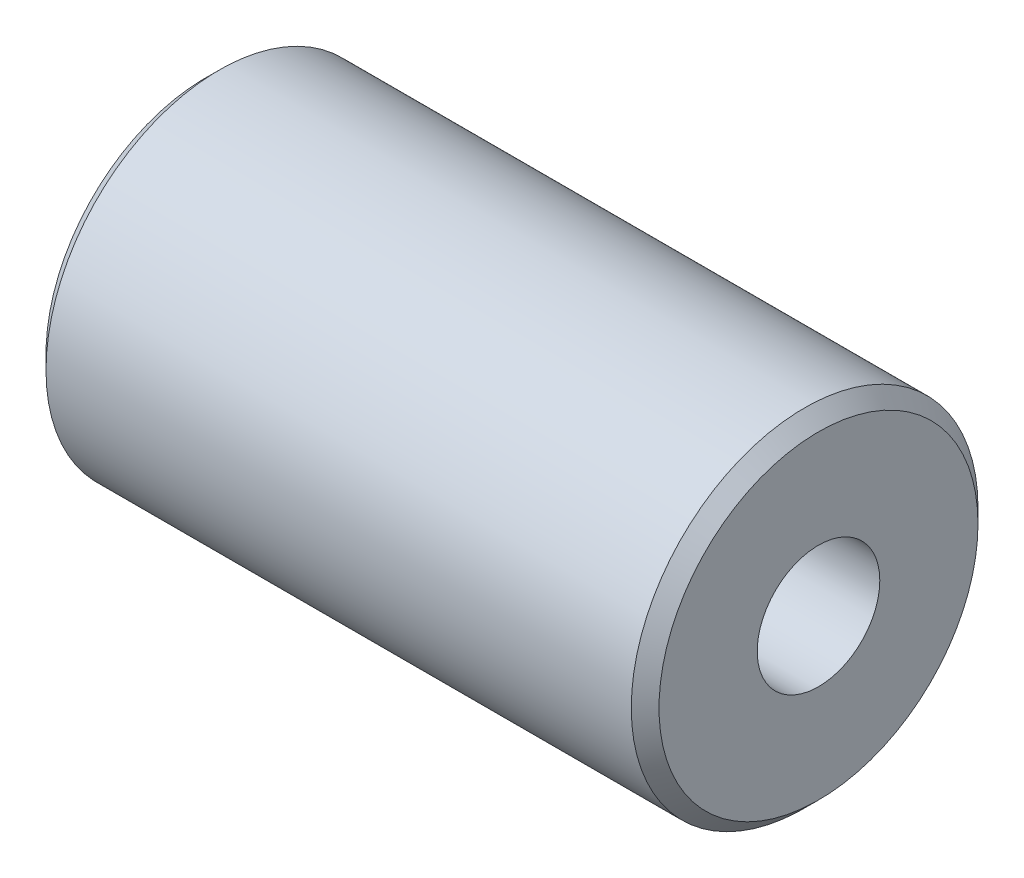
ISO-10303-21;
HEADER;
FILE_DESCRIPTION(('STEP AP214'),'2;1');
FILE_NAME('part.step','',(''),(''),'','','');
FILE_SCHEMA(('AUTOMOTIVE_DESIGN { 1 0 10303 214 1 1 1 1 }'));
ENDSEC;
DATA;
#1=APPLICATION_CONTEXT('core data for automotive mechanical design processes');
#2=APPLICATION_PROTOCOL_DEFINITION('international standard','automotive_design',2000,#1);
#3=PRODUCT_CONTEXT('',#1,'mechanical');
#4=PRODUCT('Part','Part','',(#3));
#5=PRODUCT_RELATED_PRODUCT_CATEGORY('part','',(#4));
#6=PRODUCT_DEFINITION_FORMATION('','',#4);
#7=PRODUCT_DEFINITION_CONTEXT('part definition',#1,'design');
#8=PRODUCT_DEFINITION('design','',#6,#7);
#9=PRODUCT_DEFINITION_SHAPE('','',#8);
#10=(LENGTH_UNIT() NAMED_UNIT(*) SI_UNIT(.MILLI.,.METRE.));
#11=(NAMED_UNIT(*) PLANE_ANGLE_UNIT() SI_UNIT($,.RADIAN.));
#12=(NAMED_UNIT(*) SI_UNIT($,.STERADIAN.) SOLID_ANGLE_UNIT());
#13=UNCERTAINTY_MEASURE_WITH_UNIT(LENGTH_MEASURE(1.E-05),#10,'distance_accuracy_value','');
#14=(GEOMETRIC_REPRESENTATION_CONTEXT(3) GLOBAL_UNCERTAINTY_ASSIGNED_CONTEXT((#13)) GLOBAL_UNIT_ASSIGNED_CONTEXT((#10,
#11,#12)) REPRESENTATION_CONTEXT('',''));
#15=CARTESIAN_POINT('',(0.,0.,0.));
#16=DIRECTION('',(0.,0.,1.));
#17=DIRECTION('',(1.,0.,0.));
#18=AXIS2_PLACEMENT_3D('',#15,#16,#17);
#19=CARTESIAN_POINT('',(-22.1,0.,0.));
#20=DIRECTION('',(1.,0.,0.));
#21=DIRECTION('',(0.,0.,-1.));
#22=AXIS2_PLACEMENT_3D('',#19,#20,#21);
#23=CYLINDRICAL_SURFACE('',#22,12.5);
#24=CARTESIAN_POINT('',(21.1,0.,0.));
#25=DIRECTION('',(1.,0.,0.));
#26=DIRECTION('',(0.,0.,-1.));
#27=AXIS2_PLACEMENT_3D('',#24,#25,#26);
#28=CIRCLE('',#27,12.5);
#29=CARTESIAN_POINT('',(21.1,0.,-12.5));
#30=VERTEX_POINT('',#29);
#31=EDGE_CURVE('E45',#30,#30,#28,.F.);
#32=ORIENTED_EDGE('',*,*,#31,.T.);
#33=EDGE_LOOP('',(#32));
#34=FACE_BOUND('',#33,.T.);
#35=CARTESIAN_POINT('',(-21.1,0.,0.));
#36=DIRECTION('',(1.,0.,0.));
#37=DIRECTION('',(0.,0.,-1.));
#38=AXIS2_PLACEMENT_3D('',#35,#36,#37);
#39=CIRCLE('',#38,12.5);
#40=CARTESIAN_POINT('',(-21.1,0.,-12.5));
#41=VERTEX_POINT('',#40);
#42=EDGE_CURVE('E49',#41,#41,#39,.T.);
#43=ORIENTED_EDGE('',*,*,#42,.T.);
#44=EDGE_LOOP('',(#43));
#45=FACE_BOUND('',#44,.T.);
#46=ADVANCED_FACE('F38',(#34,#45),#23,.T.);
#47=CARTESIAN_POINT('',(-22.1,0.,0.));
#48=DIRECTION('',(1.,0.,0.));
#49=DIRECTION('',(0.,0.,-1.));
#50=AXIS2_PLACEMENT_3D('',#47,#48,#49);
#51=PLANE('',#50);
#52=CARTESIAN_POINT('',(-22.1,0.,0.));
#53=DIRECTION('',(1.,0.,0.));
#54=DIRECTION('',(0.,0.,-1.));
#55=AXIS2_PLACEMENT_3D('',#52,#53,#54);
#56=CIRCLE('',#55,11.5);
#57=CARTESIAN_POINT('',(-22.1,0.,-11.5));
#58=VERTEX_POINT('',#57);
#59=EDGE_CURVE('E10',#58,#58,#56,.F.);
#60=ORIENTED_EDGE('',*,*,#59,.T.);
#61=EDGE_LOOP('',(#60));
#62=FACE_BOUND('',#61,.T.);
#63=CARTESIAN_POINT('',(-22.1,0.,0.));
#64=DIRECTION('',(1.,0.,0.));
#65=DIRECTION('',(0.,0.,-1.));
#66=AXIS2_PLACEMENT_3D('',#63,#64,#65);
#67=CIRCLE('',#66,4.4196);
#68=CARTESIAN_POINT('',(-22.1,0.,-4.4196));
#69=VERTEX_POINT('',#68);
#70=EDGE_CURVE('E58',#69,#69,#67,.T.);
#71=ORIENTED_EDGE('',*,*,#70,.T.);
#72=EDGE_LOOP('',(#71));
#73=FACE_BOUND('',#72,.T.);
#74=ADVANCED_FACE('F77',(#62,#73),#51,.F.);
#75=CARTESIAN_POINT('',(-22.1,0.,0.));
#76=DIRECTION('',(1.,0.,0.));
#77=DIRECTION('',(0.,0.,-1.));
#78=AXIS2_PLACEMENT_3D('',#75,#76,#77);
#79=CYLINDRICAL_SURFACE('',#78,4.4196);
#80=ORIENTED_EDGE('',*,*,#70,.F.);
#81=EDGE_LOOP('',(#80));
#82=FACE_BOUND('',#81,.T.);
#83=CARTESIAN_POINT('',(22.1,0.,0.));
#84=DIRECTION('',(1.,0.,0.));
#85=DIRECTION('',(0.,0.,-1.));
#86=AXIS2_PLACEMENT_3D('',#83,#84,#85);
#87=CIRCLE('',#86,4.4196);
#88=CARTESIAN_POINT('',(22.1,0.,-4.4196));
#89=VERTEX_POINT('',#88);
#90=EDGE_CURVE('E61',#89,#89,#87,.T.);
#91=ORIENTED_EDGE('',*,*,#90,.T.);
#92=EDGE_LOOP('',(#91));
#93=FACE_BOUND('',#92,.T.);
#94=ADVANCED_FACE('F65',(#82,#93),#79,.F.);
#95=CARTESIAN_POINT('',(22.1,0.,0.));
#96=DIRECTION('',(1.,0.,0.));
#97=DIRECTION('',(0.,0.,-1.));
#98=AXIS2_PLACEMENT_3D('',#95,#96,#97);
#99=PLANE('',#98);
#100=CARTESIAN_POINT('',(22.1,0.,0.));
#101=DIRECTION('',(1.,0.,0.));
#102=DIRECTION('',(0.,0.,-1.));
#103=AXIS2_PLACEMENT_3D('',#100,#101,#102);
#104=CIRCLE('',#103,11.5);
#105=CARTESIAN_POINT('',(22.1,0.,-11.5));
#106=VERTEX_POINT('',#105);
#107=EDGE_CURVE('E53',#106,#106,#104,.T.);
#108=ORIENTED_EDGE('',*,*,#107,.T.);
#109=EDGE_LOOP('',(#108));
#110=FACE_BOUND('',#109,.T.);
#111=ORIENTED_EDGE('',*,*,#90,.F.);
#112=EDGE_LOOP('',(#111));
#113=FACE_BOUND('',#112,.T.);
#114=ADVANCED_FACE('F67',(#110,#113),#99,.T.);
#115=CARTESIAN_POINT('',(22.1,0.,0.));
#116=DIRECTION('',(-1.,0.,0.));
#117=DIRECTION('',(0.,0.,1.));
#118=AXIS2_PLACEMENT_3D('',#115,#116,#117);
#119=CONICAL_SURFACE('',#118,11.5,0.785398163397443);
#120=ORIENTED_EDGE('',*,*,#31,.F.);
#121=EDGE_LOOP('',(#120));
#122=FACE_BOUND('',#121,.T.);
#123=ORIENTED_EDGE('',*,*,#107,.F.);
#124=EDGE_LOOP('',(#123));
#125=FACE_BOUND('',#124,.T.);
#126=ADVANCED_FACE('F69',(#122,#125),#119,.T.);
#127=CARTESIAN_POINT('',(-21.1,0.,0.));
#128=DIRECTION('',(1.,0.,0.));
#129=DIRECTION('',(0.,0.,-1.));
#130=AXIS2_PLACEMENT_3D('',#127,#128,#129);
#131=CONICAL_SURFACE('',#130,12.5,0.78539816339745);
#132=ORIENTED_EDGE('',*,*,#59,.F.);
#133=EDGE_LOOP('',(#132));
#134=FACE_BOUND('',#133,.T.);
#135=ORIENTED_EDGE('',*,*,#42,.F.);
#136=EDGE_LOOP('',(#135));
#137=FACE_BOUND('',#136,.T.);
#138=ADVANCED_FACE('F40',(#134,#137),#131,.T.);
#139=CLOSED_SHELL('',(#46,#74,#94,#114,#126,#138));
#140=MANIFOLD_SOLID_BREP('B2',#139);
#141=ADVANCED_BREP_SHAPE_REPRESENTATION('',(#18,#140),#14);
#142=SHAPE_DEFINITION_REPRESENTATION(#9,#141);
ENDSEC;
END-ISO-10303-21;
